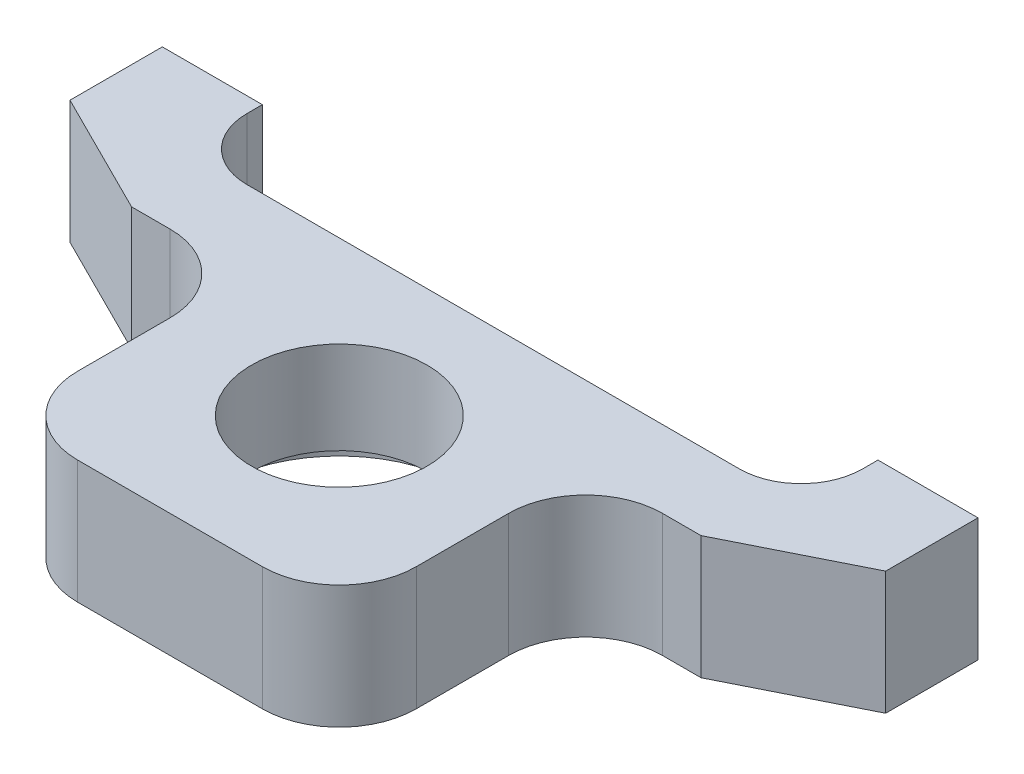
ISO-10303-21;
HEADER;
FILE_DESCRIPTION(('STEP AP214'),'2;1');
FILE_NAME('part.step','',(''),(''),'','','');
FILE_SCHEMA(('AUTOMOTIVE_DESIGN { 1 0 10303 214 1 1 1 1 }'));
ENDSEC;
DATA;
#1=APPLICATION_CONTEXT('core data for automotive mechanical design processes');
#2=APPLICATION_PROTOCOL_DEFINITION('international standard','automotive_design',2000,#1);
#3=PRODUCT_CONTEXT('',#1,'mechanical');
#4=PRODUCT('Part','Part','',(#3));
#5=PRODUCT_RELATED_PRODUCT_CATEGORY('part','',(#4));
#6=PRODUCT_DEFINITION_FORMATION('','',#4);
#7=PRODUCT_DEFINITION_CONTEXT('part definition',#1,'design');
#8=PRODUCT_DEFINITION('design','',#6,#7);
#9=PRODUCT_DEFINITION_SHAPE('','',#8);
#10=(LENGTH_UNIT() NAMED_UNIT(*) SI_UNIT(.MILLI.,.METRE.));
#11=(NAMED_UNIT(*) PLANE_ANGLE_UNIT() SI_UNIT($,.RADIAN.));
#12=(NAMED_UNIT(*) SI_UNIT($,.STERADIAN.) SOLID_ANGLE_UNIT());
#13=UNCERTAINTY_MEASURE_WITH_UNIT(LENGTH_MEASURE(1.E-05),#10,'distance_accuracy_value','');
#14=(GEOMETRIC_REPRESENTATION_CONTEXT(3) GLOBAL_UNCERTAINTY_ASSIGNED_CONTEXT((#13)) GLOBAL_UNIT_ASSIGNED_CONTEXT((#10,
#11,#12)) REPRESENTATION_CONTEXT('',''));
#15=CARTESIAN_POINT('',(0.,0.,0.));
#16=DIRECTION('',(0.,0.,1.));
#17=DIRECTION('',(1.,0.,0.));
#18=AXIS2_PLACEMENT_3D('',#15,#16,#17);
#19=CARTESIAN_POINT('',(-26.5,8.,0.));
#20=DIRECTION('',(0.,0.,-1.));
#21=DIRECTION('',(-1.,0.,0.));
#22=AXIS2_PLACEMENT_3D('',#19,#20,#21);
#23=PLANE('',#22);
#24=CARTESIAN_POINT('',(23.25,4.,0.));
#25=DIRECTION('',(0.,0.,-1.));
#26=DIRECTION('',(-1.,0.,0.));
#27=AXIS2_PLACEMENT_3D('',#24,#25,#26);
#28=CIRCLE('',#27,1.64999999999999);
#29=CARTESIAN_POINT('',(21.6,4.,0.));
#30=VERTEX_POINT('',#29);
#31=EDGE_CURVE('E184',#30,#30,#28,.T.);
#32=ORIENTED_EDGE('',*,*,#31,.F.);
#33=EDGE_LOOP('',(#32));
#34=FACE_BOUND('',#33,.T.);
#35=DIRECTION('',(0.,1.,0.));
#36=VECTOR('',#35,1.);
#37=CARTESIAN_POINT('',(20.,0.,0.));
#38=LINE('',#37,#36);
#39=CARTESIAN_POINT('',(20.,0.,0.));
#40=VERTEX_POINT('',#39);
#41=CARTESIAN_POINT('',(20.,8.,0.));
#42=VERTEX_POINT('',#41);
#43=EDGE_CURVE('E223',#40,#42,#38,.T.);
#44=ORIENTED_EDGE('',*,*,#43,.T.);
#45=DIRECTION('',(1.,0.,0.));
#46=VECTOR('',#45,1.);
#47=CARTESIAN_POINT('',(-26.5,8.,0.));
#48=LINE('',#47,#46);
#49=CARTESIAN_POINT('',(26.5,8.,0.));
#50=VERTEX_POINT('',#49);
#51=EDGE_CURVE('E254',#42,#50,#48,.T.);
#52=ORIENTED_EDGE('',*,*,#51,.T.);
#53=DIRECTION('',(0.,-1.,0.));
#54=VECTOR('',#53,1.);
#55=CARTESIAN_POINT('',(26.5,8.,0.));
#56=LINE('',#55,#54);
#57=CARTESIAN_POINT('',(26.5,0.,0.));
#58=VERTEX_POINT('',#57);
#59=EDGE_CURVE('E261',#50,#58,#56,.T.);
#60=ORIENTED_EDGE('',*,*,#59,.T.);
#61=DIRECTION('',(1.,0.,0.));
#62=VECTOR('',#61,1.);
#63=CARTESIAN_POINT('',(-26.5,0.,0.));
#64=LINE('',#63,#62);
#65=EDGE_CURVE('E246',#40,#58,#64,.T.);
#66=ORIENTED_EDGE('',*,*,#65,.F.);
#67=EDGE_LOOP('',(#44,#52,#60,#66));
#68=FACE_BOUND('',#67,.T.);
#69=ADVANCED_FACE('F32',(#34,#68),#23,.T.);
#70=CARTESIAN_POINT('',(-23.25,4.,0.));
#71=DIRECTION('',(0.,0.,-1.));
#72=DIRECTION('',(-1.,0.,0.));
#73=AXIS2_PLACEMENT_3D('',#70,#71,#72);
#74=CIRCLE('',#73,1.64999999999999);
#75=CARTESIAN_POINT('',(-24.9,4.,0.));
#76=VERTEX_POINT('',#75);
#77=EDGE_CURVE('E183',#76,#76,#74,.T.);
#78=ORIENTED_EDGE('',*,*,#77,.F.);
#79=EDGE_LOOP('',(#78));
#80=FACE_BOUND('',#79,.T.);
#81=DIRECTION('',(0.,1.,0.));
#82=VECTOR('',#81,1.);
#83=CARTESIAN_POINT('',(-20.000000023,0.,0.));
#84=LINE('',#83,#82);
#85=CARTESIAN_POINT('',(-20.000000023,0.,0.));
#86=VERTEX_POINT('',#85);
#87=CARTESIAN_POINT('',(-20.000000023,8.,0.));
#88=VERTEX_POINT('',#87);
#89=EDGE_CURVE('E216',#86,#88,#84,.T.);
#90=ORIENTED_EDGE('',*,*,#89,.F.);
#91=CARTESIAN_POINT('',(-26.5,0.,0.));
#92=VERTEX_POINT('',#91);
#93=EDGE_CURVE('E262',#92,#86,#64,.T.);
#94=ORIENTED_EDGE('',*,*,#93,.F.);
#95=DIRECTION('',(0.,-1.,0.));
#96=VECTOR('',#95,1.);
#97=CARTESIAN_POINT('',(-26.5,8.,0.));
#98=LINE('',#97,#96);
#99=CARTESIAN_POINT('',(-26.5,8.,0.));
#100=VERTEX_POINT('',#99);
#101=EDGE_CURVE('E272',#100,#92,#98,.T.);
#102=ORIENTED_EDGE('',*,*,#101,.F.);
#103=EDGE_CURVE('E250',#100,#88,#48,.T.);
#104=ORIENTED_EDGE('',*,*,#103,.T.);
#105=EDGE_LOOP('',(#90,#94,#102,#104));
#106=FACE_BOUND('',#105,.T.);
#107=ADVANCED_FACE('F404',(#80,#106),#23,.T.);
#108=CARTESIAN_POINT('',(-26.5,8.,26.));
#109=DIRECTION('',(-1.,0.,0.));
#110=DIRECTION('',(0.,0.,1.));
#111=AXIS2_PLACEMENT_3D('',#108,#109,#110);
#112=PLANE('',#111);
#113=DIRECTION('',(0.,0.,-1.));
#114=VECTOR('',#113,1.);
#115=CARTESIAN_POINT('',(-26.5,0.,26.));
#116=LINE('',#115,#114);
#117=CARTESIAN_POINT('',(-26.5,0.,5.99999999999999));
#118=VERTEX_POINT('',#117);
#119=EDGE_CURVE('E270',#118,#92,#116,.T.);
#120=ORIENTED_EDGE('',*,*,#119,.F.);
#121=DIRECTION('',(0.,1.,0.));
#122=VECTOR('',#121,1.);
#123=CARTESIAN_POINT('',(-26.5,8.,5.99999999999999));
#124=LINE('',#123,#122);
#125=CARTESIAN_POINT('',(-26.5,8.,5.99999999999999));
#126=VERTEX_POINT('',#125);
#127=EDGE_CURVE('E333',#118,#126,#124,.T.);
#128=ORIENTED_EDGE('',*,*,#127,.T.);
#129=DIRECTION('',(0.,0.,-1.));
#130=VECTOR('',#129,1.);
#131=CARTESIAN_POINT('',(-26.5,8.,26.));
#132=LINE('',#131,#130);
#133=EDGE_CURVE('E259',#126,#100,#132,.T.);
#134=ORIENTED_EDGE('',*,*,#133,.T.);
#135=ORIENTED_EDGE('',*,*,#101,.T.);
#136=EDGE_LOOP('',(#120,#128,#134,#135));
#137=FACE_BOUND('',#136,.T.);
#138=ADVANCED_FACE('F397',(#137),#112,.T.);
#139=CARTESIAN_POINT('',(26.5,8.,26.));
#140=DIRECTION('',(0.,0.,1.));
#141=DIRECTION('',(1.,0.,0.));
#142=AXIS2_PLACEMENT_3D('',#139,#140,#141);
#143=PLANE('',#142);
#144=DIRECTION('',(-1.,0.,0.));
#145=VECTOR('',#144,1.);
#146=CARTESIAN_POINT('',(26.5,0.,26.));
#147=LINE('',#146,#145);
#148=CARTESIAN_POINT('',(6.,0.,26.));
#149=VERTEX_POINT('',#148);
#150=CARTESIAN_POINT('',(-6.,0.,26.));
#151=VERTEX_POINT('',#150);
#152=EDGE_CURVE('E267',#149,#151,#147,.T.);
#153=ORIENTED_EDGE('',*,*,#152,.F.);
#154=DIRECTION('',(0.,1.,0.));
#155=VECTOR('',#154,1.);
#156=CARTESIAN_POINT('',(6.,8.,26.));
#157=LINE('',#156,#155);
#158=CARTESIAN_POINT('',(6.,8.,26.));
#159=VERTEX_POINT('',#158);
#160=EDGE_CURVE('E305',#149,#159,#157,.T.);
#161=ORIENTED_EDGE('',*,*,#160,.T.);
#162=DIRECTION('',(-1.,0.,0.));
#163=VECTOR('',#162,1.);
#164=CARTESIAN_POINT('',(26.5,8.,26.));
#165=LINE('',#164,#163);
#166=CARTESIAN_POINT('',(-6.,8.,26.));
#167=VERTEX_POINT('',#166);
#168=EDGE_CURVE('E256',#159,#167,#165,.T.);
#169=ORIENTED_EDGE('',*,*,#168,.T.);
#170=DIRECTION('',(0.,1.,0.));
#171=VECTOR('',#170,1.);
#172=CARTESIAN_POINT('',(-6.,0.,26.));
#173=LINE('',#172,#171);
#174=EDGE_CURVE('E303',#167,#151,#173,.F.);
#175=ORIENTED_EDGE('',*,*,#174,.T.);
#176=EDGE_LOOP('',(#153,#161,#169,#175));
#177=FACE_BOUND('',#176,.T.);
#178=ADVANCED_FACE('F371',(#177),#143,.T.);
#179=CARTESIAN_POINT('',(26.5,8.,0.));
#180=DIRECTION('',(1.,0.,0.));
#181=DIRECTION('',(0.,0.,-1.));
#182=AXIS2_PLACEMENT_3D('',#179,#180,#181);
#183=PLANE('',#182);
#184=DIRECTION('',(0.,0.,1.));
#185=VECTOR('',#184,1.);
#186=CARTESIAN_POINT('',(26.5,8.,0.));
#187=LINE('',#186,#185);
#188=CARTESIAN_POINT('',(26.5,8.,6.));
#189=VERTEX_POINT('',#188);
#190=EDGE_CURVE('E253',#50,#189,#187,.T.);
#191=ORIENTED_EDGE('',*,*,#190,.T.);
#192=DIRECTION('',(0.,-1.,0.));
#193=VECTOR('',#192,1.);
#194=CARTESIAN_POINT('',(26.5,0.,6.));
#195=LINE('',#194,#193);
#196=CARTESIAN_POINT('',(26.5,0.,6.));
#197=VERTEX_POINT('',#196);
#198=EDGE_CURVE('E40',#189,#197,#195,.T.);
#199=ORIENTED_EDGE('',*,*,#198,.T.);
#200=DIRECTION('',(0.,0.,1.));
#201=VECTOR('',#200,1.);
#202=CARTESIAN_POINT('',(26.5,0.,0.));
#203=LINE('',#202,#201);
#204=EDGE_CURVE('E265',#58,#197,#203,.T.);
#205=ORIENTED_EDGE('',*,*,#204,.F.);
#206=ORIENTED_EDGE('',*,*,#59,.F.);
#207=EDGE_LOOP('',(#191,#199,#205,#206));
#208=FACE_BOUND('',#207,.T.);
#209=ADVANCED_FACE('F430',(#208),#183,.T.);
#210=CARTESIAN_POINT('',(0.,8.,0.));
#211=DIRECTION('',(0.,-1.,0.));
#212=DIRECTION('',(0.,0.,-1.));
#213=AXIS2_PLACEMENT_3D('',#210,#211,#212);
#214=PLANE('',#213);
#215=CARTESIAN_POINT('',(0.,8.00000000000001,15.));
#216=DIRECTION('',(0.,-1.,0.));
#217=DIRECTION('',(0.,0.,-1.));
#218=AXIS2_PLACEMENT_3D('',#215,#216,#217);
#219=CIRCLE('',#218,5.70000000000001);
#220=CARTESIAN_POINT('',(0.,8.00000000000001,9.29999999999999));
#221=VERTEX_POINT('',#220);
#222=EDGE_CURVE('E203',#221,#221,#219,.T.);
#223=ORIENTED_EDGE('',*,*,#222,.T.);
#224=EDGE_LOOP('',(#223));
#225=FACE_BOUND('',#224,.T.);
#226=DIRECTION('',(-1.,0.,0.));
#227=VECTOR('',#226,1.);
#228=CARTESIAN_POINT('',(26.5,8.,10.));
#229=LINE('',#228,#227);
#230=CARTESIAN_POINT('',(18.5,8.,10.));
#231=VERTEX_POINT('',#230);
#232=CARTESIAN_POINT('',(16.,8.,10.));
#233=VERTEX_POINT('',#232);
#234=EDGE_CURVE('E235',#231,#233,#229,.T.);
#235=ORIENTED_EDGE('',*,*,#234,.F.);
#236=DIRECTION('',(0.894427190999917,0.,-0.447213595499956));
#237=VECTOR('',#236,1.);
#238=CARTESIAN_POINT('',(18.5,8.,10.));
#239=LINE('',#238,#237);
#240=EDGE_CURVE('E54',#231,#189,#239,.T.);
#241=ORIENTED_EDGE('',*,*,#240,.T.);
#242=ORIENTED_EDGE('',*,*,#190,.F.);
#243=ORIENTED_EDGE('',*,*,#51,.F.);
#244=DIRECTION('',(0.,0.,-1.));
#245=VECTOR('',#244,1.);
#246=CARTESIAN_POINT('',(20.,8.,5.));
#247=LINE('',#246,#245);
#248=CARTESIAN_POINT('',(20.,8.,1.));
#249=VERTEX_POINT('',#248);
#250=EDGE_CURVE('E211',#249,#42,#247,.T.);
#251=ORIENTED_EDGE('',*,*,#250,.F.);
#252=CARTESIAN_POINT('',(16.,8.,1.));
#253=DIRECTION('',(0.,-1.,0.));
#254=DIRECTION('',(0.,0.,-1.));
#255=AXIS2_PLACEMENT_3D('',#252,#253,#254);
#256=CIRCLE('',#255,4.);
#257=CARTESIAN_POINT('',(16.,8.,5.));
#258=VERTEX_POINT('',#257);
#259=EDGE_CURVE('E291',#249,#258,#256,.T.);
#260=ORIENTED_EDGE('',*,*,#259,.T.);
#261=DIRECTION('',(1.,0.,0.));
#262=VECTOR('',#261,1.);
#263=CARTESIAN_POINT('',(-20.000000023,8.,5.00000000000001));
#264=LINE('',#263,#262);
#265=CARTESIAN_POINT('',(-16.000000023,8.,5.00000000000001));
#266=VERTEX_POINT('',#265);
#267=EDGE_CURVE('E219',#266,#258,#264,.T.);
#268=ORIENTED_EDGE('',*,*,#267,.F.);
#269=CARTESIAN_POINT('',(-16.000000023,8.,1.00000000000001));
#270=DIRECTION('',(0.,-1.,0.));
#271=DIRECTION('',(0.,0.,-1.));
#272=AXIS2_PLACEMENT_3D('',#269,#270,#271);
#273=CIRCLE('',#272,4.);
#274=CARTESIAN_POINT('',(-20.000000023,8.,1.00000000000001));
#275=VERTEX_POINT('',#274);
#276=EDGE_CURVE('E287',#266,#275,#273,.T.);
#277=ORIENTED_EDGE('',*,*,#276,.T.);
#278=DIRECTION('',(0.,0.,1.));
#279=VECTOR('',#278,1.);
#280=CARTESIAN_POINT('',(-20.000000023,8.,0.));
#281=LINE('',#280,#279);
#282=EDGE_CURVE('E206',#88,#275,#281,.T.);
#283=ORIENTED_EDGE('',*,*,#282,.F.);
#284=ORIENTED_EDGE('',*,*,#103,.F.);
#285=ORIENTED_EDGE('',*,*,#133,.F.);
#286=DIRECTION('',(0.894427190999917,0.,0.447213595499956));
#287=VECTOR('',#286,1.);
#288=CARTESIAN_POINT('',(-26.5,8.,5.99999999999999));
#289=LINE('',#288,#287);
#290=CARTESIAN_POINT('',(-18.4999999999999,8.,10.));
#291=VERTEX_POINT('',#290);
#292=EDGE_CURVE('E336',#126,#291,#289,.T.);
#293=ORIENTED_EDGE('',*,*,#292,.T.);
#294=DIRECTION('',(-1.,0.,0.));
#295=VECTOR('',#294,1.);
#296=CARTESIAN_POINT('',(-11.,8.,10.));
#297=LINE('',#296,#295);
#298=CARTESIAN_POINT('',(-16.,8.,10.));
#299=VERTEX_POINT('',#298);
#300=EDGE_CURVE('E232',#299,#291,#297,.T.);
#301=ORIENTED_EDGE('',*,*,#300,.F.);
#302=CARTESIAN_POINT('',(-16.,8.,15.));
#303=DIRECTION('',(0.,-1.,0.));
#304=DIRECTION('',(0.,0.,-1.));
#305=AXIS2_PLACEMENT_3D('',#302,#303,#304);
#306=CIRCLE('',#305,5.);
#307=CARTESIAN_POINT('',(-11.,8.,15.));
#308=VERTEX_POINT('',#307);
#309=EDGE_CURVE('E329',#299,#308,#306,.T.);
#310=ORIENTED_EDGE('',*,*,#309,.T.);
#311=DIRECTION('',(0.,0.,-1.));
#312=VECTOR('',#311,1.);
#313=CARTESIAN_POINT('',(-11.,8.,26.));
#314=LINE('',#313,#312);
#315=CARTESIAN_POINT('',(-11.,8.,21.));
#316=VERTEX_POINT('',#315);
#317=EDGE_CURVE('E226',#316,#308,#314,.T.);
#318=ORIENTED_EDGE('',*,*,#317,.F.);
#319=CARTESIAN_POINT('',(-6.,8.,21.));
#320=DIRECTION('',(0.,-1.,0.));
#321=DIRECTION('',(0.,0.,-1.));
#322=AXIS2_PLACEMENT_3D('',#319,#320,#321);
#323=CIRCLE('',#322,5.);
#324=EDGE_CURVE('E308',#316,#167,#323,.F.);
#325=ORIENTED_EDGE('',*,*,#324,.T.);
#326=ORIENTED_EDGE('',*,*,#168,.F.);
#327=CARTESIAN_POINT('',(6.,8.,21.));
#328=DIRECTION('',(0.,-1.,0.));
#329=DIRECTION('',(0.,0.,-1.));
#330=AXIS2_PLACEMENT_3D('',#327,#328,#329);
#331=CIRCLE('',#330,5.);
#332=CARTESIAN_POINT('',(11.,8.,21.));
#333=VERTEX_POINT('',#332);
#334=EDGE_CURVE('E310',#159,#333,#331,.F.);
#335=ORIENTED_EDGE('',*,*,#334,.T.);
#336=DIRECTION('',(0.,0.,1.));
#337=VECTOR('',#336,1.);
#338=CARTESIAN_POINT('',(11.,8.,10.));
#339=LINE('',#338,#337);
#340=CARTESIAN_POINT('',(11.,8.,15.));
#341=VERTEX_POINT('',#340);
#342=EDGE_CURVE('E243',#341,#333,#339,.T.);
#343=ORIENTED_EDGE('',*,*,#342,.F.);
#344=CARTESIAN_POINT('',(16.,8.,15.));
#345=DIRECTION('',(0.,-1.,0.));
#346=DIRECTION('',(0.,0.,-1.));
#347=AXIS2_PLACEMENT_3D('',#344,#345,#346);
#348=CIRCLE('',#347,5.);
#349=EDGE_CURVE('E324',#341,#233,#348,.T.);
#350=ORIENTED_EDGE('',*,*,#349,.T.);
#351=EDGE_LOOP('',(#235,#241,#242,#243,#251,#260,#268,#277,#283,#284,#285,#293,#301,#310,#318,
#325,#326,#335,#343,#350));
#352=FACE_BOUND('',#351,.T.);
#353=ADVANCED_FACE('F351',(#225,#352),#214,.F.);
#354=CARTESIAN_POINT('',(0.,0.,0.));
#355=DIRECTION('',(0.,-1.,0.));
#356=DIRECTION('',(0.,0.,-1.));
#357=AXIS2_PLACEMENT_3D('',#354,#355,#356);
#358=PLANE('',#357);
#359=CARTESIAN_POINT('',(0.,0.,15.));
#360=DIRECTION('',(0.,-1.,0.));
#361=DIRECTION('',(0.,0.,-1.));
#362=AXIS2_PLACEMENT_3D('',#359,#360,#361);
#363=CIRCLE('',#362,8.1);
#364=CARTESIAN_POINT('',(0.,0.,6.9));
#365=VERTEX_POINT('',#364);
#366=EDGE_CURVE('E194',#365,#365,#363,.T.);
#367=ORIENTED_EDGE('',*,*,#366,.F.);
#368=EDGE_LOOP('',(#367));
#369=FACE_BOUND('',#368,.T.);
#370=ORIENTED_EDGE('',*,*,#204,.T.);
#371=DIRECTION('',(-0.894427190999917,0.,0.447213595499956));
#372=VECTOR('',#371,1.);
#373=CARTESIAN_POINT('',(7.69999999999995,0.,15.4));
#374=LINE('',#373,#372);
#375=CARTESIAN_POINT('',(18.5,0.,9.99999999999999));
#376=VERTEX_POINT('',#375);
#377=EDGE_CURVE('E11',#197,#376,#374,.T.);
#378=ORIENTED_EDGE('',*,*,#377,.T.);
#379=DIRECTION('',(-1.,0.,0.));
#380=VECTOR('',#379,1.);
#381=CARTESIAN_POINT('',(26.5,0.,10.));
#382=LINE('',#381,#380);
#383=CARTESIAN_POINT('',(16.,0.,10.));
#384=VERTEX_POINT('',#383);
#385=EDGE_CURVE('E240',#376,#384,#382,.T.);
#386=ORIENTED_EDGE('',*,*,#385,.T.);
#387=CARTESIAN_POINT('',(16.,0.,15.));
#388=DIRECTION('',(0.,-1.,0.));
#389=DIRECTION('',(0.,0.,-1.));
#390=AXIS2_PLACEMENT_3D('',#387,#388,#389);
#391=CIRCLE('',#390,5.);
#392=CARTESIAN_POINT('',(11.,0.,15.));
#393=VERTEX_POINT('',#392);
#394=EDGE_CURVE('E327',#384,#393,#391,.F.);
#395=ORIENTED_EDGE('',*,*,#394,.T.);
#396=DIRECTION('',(0.,0.,1.));
#397=VECTOR('',#396,1.);
#398=CARTESIAN_POINT('',(11.,0.,10.));
#399=LINE('',#398,#397);
#400=CARTESIAN_POINT('',(11.,0.,21.));
#401=VERTEX_POINT('',#400);
#402=EDGE_CURVE('E242',#393,#401,#399,.T.);
#403=ORIENTED_EDGE('',*,*,#402,.T.);
#404=CARTESIAN_POINT('',(6.,0.,21.));
#405=DIRECTION('',(0.,-1.,0.));
#406=DIRECTION('',(0.,0.,-1.));
#407=AXIS2_PLACEMENT_3D('',#404,#405,#406);
#408=CIRCLE('',#407,5.);
#409=EDGE_CURVE('E314',#401,#149,#408,.T.);
#410=ORIENTED_EDGE('',*,*,#409,.T.);
#411=ORIENTED_EDGE('',*,*,#152,.T.);
#412=CARTESIAN_POINT('',(-6.,0.,21.));
#413=DIRECTION('',(0.,-1.,0.));
#414=DIRECTION('',(0.,0.,-1.));
#415=AXIS2_PLACEMENT_3D('',#412,#413,#414);
#416=CIRCLE('',#415,5.);
#417=CARTESIAN_POINT('',(-11.,0.,21.));
#418=VERTEX_POINT('',#417);
#419=EDGE_CURVE('E312',#151,#418,#416,.T.);
#420=ORIENTED_EDGE('',*,*,#419,.T.);
#421=DIRECTION('',(0.,0.,-1.));
#422=VECTOR('',#421,1.);
#423=CARTESIAN_POINT('',(-11.,0.,26.));
#424=LINE('',#423,#422);
#425=CARTESIAN_POINT('',(-11.,0.,15.));
#426=VERTEX_POINT('',#425);
#427=EDGE_CURVE('E228',#418,#426,#424,.T.);
#428=ORIENTED_EDGE('',*,*,#427,.T.);
#429=CARTESIAN_POINT('',(-16.,0.,15.));
#430=DIRECTION('',(0.,-1.,0.));
#431=DIRECTION('',(0.,0.,-1.));
#432=AXIS2_PLACEMENT_3D('',#429,#430,#431);
#433=CIRCLE('',#432,5.);
#434=CARTESIAN_POINT('',(-16.,0.,10.));
#435=VERTEX_POINT('',#434);
#436=EDGE_CURVE('E331',#426,#435,#433,.F.);
#437=ORIENTED_EDGE('',*,*,#436,.T.);
#438=DIRECTION('',(-1.,0.,0.));
#439=VECTOR('',#438,1.);
#440=CARTESIAN_POINT('',(-11.,0.,10.));
#441=LINE('',#440,#439);
#442=CARTESIAN_POINT('',(-18.4999999999999,0.,10.));
#443=VERTEX_POINT('',#442);
#444=EDGE_CURVE('E231',#435,#443,#441,.T.);
#445=ORIENTED_EDGE('',*,*,#444,.T.);
#446=DIRECTION('',(-0.894427190999917,0.,-0.447213595499956));
#447=VECTOR('',#446,1.);
#448=CARTESIAN_POINT('',(-7.69999999999994,0.,15.4));
#449=LINE('',#448,#447);
#450=EDGE_CURVE('E340',#443,#118,#449,.T.);
#451=ORIENTED_EDGE('',*,*,#450,.T.);
#452=ORIENTED_EDGE('',*,*,#119,.T.);
#453=ORIENTED_EDGE('',*,*,#93,.T.);
#454=DIRECTION('',(0.,0.,1.));
#455=VECTOR('',#454,1.);
#456=CARTESIAN_POINT('',(-20.000000023,0.,0.));
#457=LINE('',#456,#455);
#458=CARTESIAN_POINT('',(-20.000000023,0.,1.00000000000001));
#459=VERTEX_POINT('',#458);
#460=EDGE_CURVE('E207',#86,#459,#457,.T.);
#461=ORIENTED_EDGE('',*,*,#460,.T.);
#462=CARTESIAN_POINT('',(-16.000000023,0.,1.00000000000001));
#463=DIRECTION('',(0.,-1.,0.));
#464=DIRECTION('',(0.,0.,-1.));
#465=AXIS2_PLACEMENT_3D('',#462,#463,#464);
#466=CIRCLE('',#465,4.);
#467=CARTESIAN_POINT('',(-16.000000023,0.,5.00000000000001));
#468=VERTEX_POINT('',#467);
#469=EDGE_CURVE('E289',#459,#468,#466,.F.);
#470=ORIENTED_EDGE('',*,*,#469,.T.);
#471=DIRECTION('',(1.,0.,0.));
#472=VECTOR('',#471,1.);
#473=CARTESIAN_POINT('',(-20.000000023,0.,5.00000000000001));
#474=LINE('',#473,#472);
#475=CARTESIAN_POINT('',(16.,0.,5.));
#476=VERTEX_POINT('',#475);
#477=EDGE_CURVE('E210',#468,#476,#474,.T.);
#478=ORIENTED_EDGE('',*,*,#477,.T.);
#479=CARTESIAN_POINT('',(16.,0.,1.));
#480=DIRECTION('',(0.,-1.,0.));
#481=DIRECTION('',(0.,0.,-1.));
#482=AXIS2_PLACEMENT_3D('',#479,#480,#481);
#483=CIRCLE('',#482,4.);
#484=CARTESIAN_POINT('',(20.,0.,1.));
#485=VERTEX_POINT('',#484);
#486=EDGE_CURVE('E293',#476,#485,#483,.F.);
#487=ORIENTED_EDGE('',*,*,#486,.T.);
#488=DIRECTION('',(0.,0.,-1.));
#489=VECTOR('',#488,1.);
#490=CARTESIAN_POINT('',(20.,0.,5.));
#491=LINE('',#490,#489);
#492=EDGE_CURVE('E214',#485,#40,#491,.T.);
#493=ORIENTED_EDGE('',*,*,#492,.T.);
#494=ORIENTED_EDGE('',*,*,#65,.T.);
#495=EDGE_LOOP('',(#370,#378,#386,#395,#403,#410,#411,#420,#428,#437,#445,#451,#452,#453,#461,
#470,#478,#487,#493,#494));
#496=FACE_BOUND('',#495,.T.);
#497=ADVANCED_FACE('F360',(#369,#496),#358,.T.);
#498=CARTESIAN_POINT('',(26.5,0.,10.));
#499=DIRECTION('',(0.,0.,-1.));
#500=DIRECTION('',(-1.,0.,0.));
#501=AXIS2_PLACEMENT_3D('',#498,#499,#500);
#502=PLANE('',#501);
#503=ORIENTED_EDGE('',*,*,#385,.F.);
#504=DIRECTION('',(0.,1.,0.));
#505=VECTOR('',#504,1.);
#506=CARTESIAN_POINT('',(18.5,8.,10.));
#507=LINE('',#506,#505);
#508=EDGE_CURVE('E342',#376,#231,#507,.T.);
#509=ORIENTED_EDGE('',*,*,#508,.T.);
#510=ORIENTED_EDGE('',*,*,#234,.T.);
#511=DIRECTION('',(0.,1.,0.));
#512=VECTOR('',#511,1.);
#513=CARTESIAN_POINT('',(16.,0.,10.));
#514=LINE('',#513,#512);
#515=EDGE_CURVE('E300',#233,#384,#514,.F.);
#516=ORIENTED_EDGE('',*,*,#515,.T.);
#517=EDGE_LOOP('',(#503,#509,#510,#516));
#518=FACE_BOUND('',#517,.T.);
#519=ADVANCED_FACE('F348',(#518),#502,.F.);
#520=CARTESIAN_POINT('',(11.,0.,10.));
#521=DIRECTION('',(-1.,0.,0.));
#522=DIRECTION('',(0.,0.,1.));
#523=AXIS2_PLACEMENT_3D('',#520,#521,#522);
#524=PLANE('',#523);
#525=ORIENTED_EDGE('',*,*,#402,.F.);
#526=DIRECTION('',(0.,1.,0.));
#527=VECTOR('',#526,1.);
#528=CARTESIAN_POINT('',(11.,8.,15.));
#529=LINE('',#528,#527);
#530=EDGE_CURVE('E297',#393,#341,#529,.T.);
#531=ORIENTED_EDGE('',*,*,#530,.T.);
#532=ORIENTED_EDGE('',*,*,#342,.T.);
#533=DIRECTION('',(0.,1.,0.));
#534=VECTOR('',#533,1.);
#535=CARTESIAN_POINT('',(11.,0.,21.));
#536=LINE('',#535,#534);
#537=EDGE_CURVE('E295',#333,#401,#536,.F.);
#538=ORIENTED_EDGE('',*,*,#537,.T.);
#539=EDGE_LOOP('',(#525,#531,#532,#538));
#540=FACE_BOUND('',#539,.T.);
#541=ADVANCED_FACE('F363',(#540),#524,.F.);
#542=CARTESIAN_POINT('',(-11.,0.,10.));
#543=DIRECTION('',(0.,0.,-1.));
#544=DIRECTION('',(-1.,0.,0.));
#545=AXIS2_PLACEMENT_3D('',#542,#543,#544);
#546=PLANE('',#545);
#547=ORIENTED_EDGE('',*,*,#300,.T.);
#548=DIRECTION('',(0.,-1.,0.));
#549=VECTOR('',#548,1.);
#550=CARTESIAN_POINT('',(-18.4999999999999,0.,10.));
#551=LINE('',#550,#549);
#552=EDGE_CURVE('E338',#291,#443,#551,.T.);
#553=ORIENTED_EDGE('',*,*,#552,.T.);
#554=ORIENTED_EDGE('',*,*,#444,.F.);
#555=DIRECTION('',(0.,1.,0.));
#556=VECTOR('',#555,1.);
#557=CARTESIAN_POINT('',(-16.,8.,10.));
#558=LINE('',#557,#556);
#559=EDGE_CURVE('E321',#435,#299,#558,.T.);
#560=ORIENTED_EDGE('',*,*,#559,.T.);
#561=EDGE_LOOP('',(#547,#553,#554,#560));
#562=FACE_BOUND('',#561,.T.);
#563=ADVANCED_FACE('F389',(#562),#546,.F.);
#564=CARTESIAN_POINT('',(-11.,0.,26.));
#565=DIRECTION('',(1.,0.,0.));
#566=DIRECTION('',(0.,0.,-1.));
#567=AXIS2_PLACEMENT_3D('',#564,#565,#566);
#568=PLANE('',#567);
#569=ORIENTED_EDGE('',*,*,#427,.F.);
#570=DIRECTION('',(0.,1.,0.));
#571=VECTOR('',#570,1.);
#572=CARTESIAN_POINT('',(-11.,8.,21.));
#573=LINE('',#572,#571);
#574=EDGE_CURVE('E318',#418,#316,#573,.T.);
#575=ORIENTED_EDGE('',*,*,#574,.T.);
#576=ORIENTED_EDGE('',*,*,#317,.T.);
#577=DIRECTION('',(0.,1.,0.));
#578=VECTOR('',#577,1.);
#579=CARTESIAN_POINT('',(-11.,0.,15.));
#580=LINE('',#579,#578);
#581=EDGE_CURVE('E316',#308,#426,#580,.F.);
#582=ORIENTED_EDGE('',*,*,#581,.T.);
#583=EDGE_LOOP('',(#569,#575,#576,#582));
#584=FACE_BOUND('',#583,.T.);
#585=ADVANCED_FACE('F380',(#584),#568,.F.);
#586=CARTESIAN_POINT('',(20.,0.,5.));
#587=DIRECTION('',(1.,0.,0.));
#588=DIRECTION('',(0.,0.,-1.));
#589=AXIS2_PLACEMENT_3D('',#586,#587,#588);
#590=PLANE('',#589);
#591=ORIENTED_EDGE('',*,*,#492,.F.);
#592=DIRECTION('',(0.,1.,0.));
#593=VECTOR('',#592,1.);
#594=CARTESIAN_POINT('',(20.,8.,1.));
#595=LINE('',#594,#593);
#596=EDGE_CURVE('E284',#485,#249,#595,.T.);
#597=ORIENTED_EDGE('',*,*,#596,.T.);
#598=ORIENTED_EDGE('',*,*,#250,.T.);
#599=ORIENTED_EDGE('',*,*,#43,.F.);
#600=EDGE_LOOP('',(#591,#597,#598,#599));
#601=FACE_BOUND('',#600,.T.);
#602=ADVANCED_FACE('F425',(#601),#590,.F.);
#603=CARTESIAN_POINT('',(-20.000000023,0.,5.00000000000001));
#604=DIRECTION('',(0.,0.,1.));
#605=DIRECTION('',(1.,0.,0.));
#606=AXIS2_PLACEMENT_3D('',#603,#604,#605);
#607=PLANE('',#606);
#608=ORIENTED_EDGE('',*,*,#477,.F.);
#609=DIRECTION('',(0.,1.,0.));
#610=VECTOR('',#609,1.);
#611=CARTESIAN_POINT('',(-16.000000023,8.,5.00000000000001));
#612=LINE('',#611,#610);
#613=EDGE_CURVE('E279',#468,#266,#612,.T.);
#614=ORIENTED_EDGE('',*,*,#613,.T.);
#615=ORIENTED_EDGE('',*,*,#267,.T.);
#616=DIRECTION('',(0.,1.,0.));
#617=VECTOR('',#616,1.);
#618=CARTESIAN_POINT('',(16.,0.,5.));
#619=LINE('',#618,#617);
#620=EDGE_CURVE('E275',#258,#476,#619,.F.);
#621=ORIENTED_EDGE('',*,*,#620,.T.);
#622=EDGE_LOOP('',(#608,#614,#615,#621));
#623=FACE_BOUND('',#622,.T.);
#624=ADVANCED_FACE('F414',(#623),#607,.F.);
#625=CARTESIAN_POINT('',(-20.000000023,0.,0.));
#626=DIRECTION('',(-1.,0.,0.));
#627=DIRECTION('',(0.,0.,1.));
#628=AXIS2_PLACEMENT_3D('',#625,#626,#627);
#629=PLANE('',#628);
#630=ORIENTED_EDGE('',*,*,#282,.T.);
#631=DIRECTION('',(0.,1.,0.));
#632=VECTOR('',#631,1.);
#633=CARTESIAN_POINT('',(-20.000000023,0.,1.00000000000001));
#634=LINE('',#633,#632);
#635=EDGE_CURVE('E282',#275,#459,#634,.F.);
#636=ORIENTED_EDGE('',*,*,#635,.T.);
#637=ORIENTED_EDGE('',*,*,#460,.F.);
#638=ORIENTED_EDGE('',*,*,#89,.T.);
#639=EDGE_LOOP('',(#630,#636,#637,#638));
#640=FACE_BOUND('',#639,.T.);
#641=ADVANCED_FACE('F581',(#640),#629,.F.);
#642=CARTESIAN_POINT('',(0.,0.,15.));
#643=DIRECTION('',(0.,-1.,0.));
#644=DIRECTION('',(0.,0.,-1.));
#645=AXIS2_PLACEMENT_3D('',#642,#643,#644);
#646=CYLINDRICAL_SURFACE('',#645,5.70000000000001);
#647=ORIENTED_EDGE('',*,*,#222,.F.);
#648=EDGE_LOOP('',(#647));
#649=FACE_BOUND('',#648,.T.);
#650=CARTESIAN_POINT('',(0.,2.,15.));
#651=DIRECTION('',(0.,-1.,0.));
#652=DIRECTION('',(0.,0.,-1.));
#653=AXIS2_PLACEMENT_3D('',#650,#651,#652);
#654=CIRCLE('',#653,5.70000000000001);
#655=CARTESIAN_POINT('',(0.,2.,9.29999999999999));
#656=VERTEX_POINT('',#655);
#657=EDGE_CURVE('E200',#656,#656,#654,.T.);
#658=ORIENTED_EDGE('',*,*,#657,.T.);
#659=EDGE_LOOP('',(#658));
#660=FACE_BOUND('',#659,.T.);
#661=ADVANCED_FACE('F586',(#649,#660),#646,.F.);
#662=CARTESIAN_POINT('',(5.70000000000001,2.,15.));
#663=DIRECTION('',(0.,1.,0.));
#664=DIRECTION('',(0.,0.,1.));
#665=AXIS2_PLACEMENT_3D('',#662,#663,#664);
#666=PLANE('',#665);
#667=ORIENTED_EDGE('',*,*,#657,.F.);
#668=EDGE_LOOP('',(#667));
#669=FACE_BOUND('',#668,.T.);
#670=CARTESIAN_POINT('',(0.,2.,15.));
#671=DIRECTION('',(0.,-1.,0.));
#672=DIRECTION('',(0.,0.,-1.));
#673=AXIS2_PLACEMENT_3D('',#670,#671,#672);
#674=CIRCLE('',#673,8.1);
#675=CARTESIAN_POINT('',(0.,2.,6.9));
#676=VERTEX_POINT('',#675);
#677=EDGE_CURVE('E197',#676,#676,#674,.T.);
#678=ORIENTED_EDGE('',*,*,#677,.T.);
#679=EDGE_LOOP('',(#678));
#680=FACE_BOUND('',#679,.T.);
#681=ADVANCED_FACE('F652',(#669,#680),#666,.F.);
#682=CARTESIAN_POINT('',(0.,0.,15.));
#683=DIRECTION('',(0.,-1.,0.));
#684=DIRECTION('',(0.,0.,-1.));
#685=AXIS2_PLACEMENT_3D('',#682,#683,#684);
#686=CYLINDRICAL_SURFACE('',#685,8.1);
#687=ORIENTED_EDGE('',*,*,#677,.F.);
#688=EDGE_LOOP('',(#687));
#689=FACE_BOUND('',#688,.T.);
#690=ORIENTED_EDGE('',*,*,#366,.T.);
#691=EDGE_LOOP('',(#690));
#692=FACE_BOUND('',#691,.T.);
#693=ADVANCED_FACE('F634',(#689,#692),#686,.F.);
#694=CARTESIAN_POINT('',(-23.25,4.,6.00000000000001));
#695=DIRECTION('',(0.,0.,-1.));
#696=DIRECTION('',(-1.,0.,0.));
#697=AXIS2_PLACEMENT_3D('',#694,#695,#696);
#698=CONICAL_SURFACE('',#697,1.64999999999998,1.02974425885275);
#699=CARTESIAN_POINT('',(-23.25,4.,6.99142002100001));
#700=VERTEX_POINT('',#699);
#701=VERTEX_LOOP('',#700);
#702=FACE_BOUND('',#701,.T.);
#703=CARTESIAN_POINT('',(-23.25,4.,6.00000000000001));
#704=DIRECTION('',(0.,0.,-1.));
#705=DIRECTION('',(-1.,0.,0.));
#706=AXIS2_PLACEMENT_3D('',#703,#704,#705);
#707=CIRCLE('',#706,1.64999999999998);
#708=CARTESIAN_POINT('',(-24.9,4.,6.00000000000001));
#709=VERTEX_POINT('',#708);
#710=EDGE_CURVE('E187',#709,#709,#707,.T.);
#711=ORIENTED_EDGE('',*,*,#710,.T.);
#712=EDGE_LOOP('',(#711));
#713=FACE_BOUND('',#712,.T.);
#714=ADVANCED_FACE('F624',(#702,#713),#698,.F.);
#715=CARTESIAN_POINT('',(-23.25,4.,0.));
#716=DIRECTION('',(0.,0.,-1.));
#717=DIRECTION('',(-1.,0.,0.));
#718=AXIS2_PLACEMENT_3D('',#715,#716,#717);
#719=CYLINDRICAL_SURFACE('',#718,1.64999999999999);
#720=ORIENTED_EDGE('',*,*,#710,.F.);
#721=EDGE_LOOP('',(#720));
#722=FACE_BOUND('',#721,.T.);
#723=ORIENTED_EDGE('',*,*,#77,.T.);
#724=EDGE_LOOP('',(#723));
#725=FACE_BOUND('',#724,.T.);
#726=ADVANCED_FACE('F177',(#722,#725),#719,.F.);
#727=CARTESIAN_POINT('',(23.25,4.,6.00000000000001));
#728=DIRECTION('',(0.,0.,-1.));
#729=DIRECTION('',(-1.,0.,0.));
#730=AXIS2_PLACEMENT_3D('',#727,#728,#729);
#731=CONICAL_SURFACE('',#730,1.64999999999998,1.02974425885275);
#732=CARTESIAN_POINT('',(23.25,4.,6.99142002100001));
#733=VERTEX_POINT('',#732);
#734=VERTEX_LOOP('',#733);
#735=FACE_BOUND('',#734,.T.);
#736=CARTESIAN_POINT('',(23.25,4.,6.00000000000001));
#737=DIRECTION('',(0.,0.,-1.));
#738=DIRECTION('',(-1.,0.,0.));
#739=AXIS2_PLACEMENT_3D('',#736,#737,#738);
#740=CIRCLE('',#739,1.64999999999998);
#741=CARTESIAN_POINT('',(21.6,4.,6.00000000000001));
#742=VERTEX_POINT('',#741);
#743=EDGE_CURVE('E181',#742,#742,#740,.T.);
#744=ORIENTED_EDGE('',*,*,#743,.T.);
#745=EDGE_LOOP('',(#744));
#746=FACE_BOUND('',#745,.T.);
#747=ADVANCED_FACE('F173',(#735,#746),#731,.F.);
#748=CARTESIAN_POINT('',(23.25,4.,0.));
#749=DIRECTION('',(0.,0.,-1.));
#750=DIRECTION('',(-1.,0.,0.));
#751=AXIS2_PLACEMENT_3D('',#748,#749,#750);
#752=CYLINDRICAL_SURFACE('',#751,1.64999999999999);
#753=ORIENTED_EDGE('',*,*,#743,.F.);
#754=EDGE_LOOP('',(#753));
#755=FACE_BOUND('',#754,.T.);
#756=ORIENTED_EDGE('',*,*,#31,.T.);
#757=EDGE_LOOP('',(#756));
#758=FACE_BOUND('',#757,.T.);
#759=ADVANCED_FACE('F176',(#755,#758),#752,.F.);
#760=CARTESIAN_POINT('',(-16.000000023,0.,1.00000000000001));
#761=DIRECTION('',(0.,-1.,0.));
#762=DIRECTION('',(0.,0.,-1.));
#763=AXIS2_PLACEMENT_3D('',#760,#761,#762);
#764=CYLINDRICAL_SURFACE('',#763,4.);
#765=ORIENTED_EDGE('',*,*,#469,.F.);
#766=ORIENTED_EDGE('',*,*,#635,.F.);
#767=ORIENTED_EDGE('',*,*,#276,.F.);
#768=ORIENTED_EDGE('',*,*,#613,.F.);
#769=EDGE_LOOP('',(#765,#766,#767,#768));
#770=FACE_BOUND('',#769,.T.);
#771=ADVANCED_FACE('F411',(#770),#764,.F.);
#772=CARTESIAN_POINT('',(16.,0.,1.));
#773=DIRECTION('',(0.,-1.,0.));
#774=DIRECTION('',(0.,0.,-1.));
#775=AXIS2_PLACEMENT_3D('',#772,#773,#774);
#776=CYLINDRICAL_SURFACE('',#775,4.);
#777=ORIENTED_EDGE('',*,*,#486,.F.);
#778=ORIENTED_EDGE('',*,*,#620,.F.);
#779=ORIENTED_EDGE('',*,*,#259,.F.);
#780=ORIENTED_EDGE('',*,*,#596,.F.);
#781=EDGE_LOOP('',(#777,#778,#779,#780));
#782=FACE_BOUND('',#781,.T.);
#783=ADVANCED_FACE('F422',(#782),#776,.F.);
#784=CARTESIAN_POINT('',(16.,0.,15.));
#785=DIRECTION('',(0.,-1.,0.));
#786=DIRECTION('',(0.,0.,-1.));
#787=AXIS2_PLACEMENT_3D('',#784,#785,#786);
#788=CYLINDRICAL_SURFACE('',#787,5.);
#789=ORIENTED_EDGE('',*,*,#394,.F.);
#790=ORIENTED_EDGE('',*,*,#515,.F.);
#791=ORIENTED_EDGE('',*,*,#349,.F.);
#792=ORIENTED_EDGE('',*,*,#530,.F.);
#793=EDGE_LOOP('',(#789,#790,#791,#792));
#794=FACE_BOUND('',#793,.T.);
#795=ADVANCED_FACE('F357',(#794),#788,.F.);
#796=CARTESIAN_POINT('',(6.,8.,21.));
#797=DIRECTION('',(0.,-1.,0.));
#798=DIRECTION('',(0.,0.,-1.));
#799=AXIS2_PLACEMENT_3D('',#796,#797,#798);
#800=CYLINDRICAL_SURFACE('',#799,5.);
#801=ORIENTED_EDGE('',*,*,#409,.F.);
#802=ORIENTED_EDGE('',*,*,#537,.F.);
#803=ORIENTED_EDGE('',*,*,#334,.F.);
#804=ORIENTED_EDGE('',*,*,#160,.F.);
#805=EDGE_LOOP('',(#801,#802,#803,#804));
#806=FACE_BOUND('',#805,.T.);
#807=ADVANCED_FACE('F366',(#806),#800,.T.);
#808=CARTESIAN_POINT('',(-6.,0.,21.));
#809=DIRECTION('',(0.,-1.,0.));
#810=DIRECTION('',(0.,0.,-1.));
#811=AXIS2_PLACEMENT_3D('',#808,#809,#810);
#812=CYLINDRICAL_SURFACE('',#811,5.);
#813=ORIENTED_EDGE('',*,*,#419,.F.);
#814=ORIENTED_EDGE('',*,*,#174,.F.);
#815=ORIENTED_EDGE('',*,*,#324,.F.);
#816=ORIENTED_EDGE('',*,*,#574,.F.);
#817=EDGE_LOOP('',(#813,#814,#815,#816));
#818=FACE_BOUND('',#817,.T.);
#819=ADVANCED_FACE('F375',(#818),#812,.T.);
#820=CARTESIAN_POINT('',(-16.,0.,15.));
#821=DIRECTION('',(0.,-1.,0.));
#822=DIRECTION('',(0.,0.,-1.));
#823=AXIS2_PLACEMENT_3D('',#820,#821,#822);
#824=CYLINDRICAL_SURFACE('',#823,5.);
#825=ORIENTED_EDGE('',*,*,#436,.F.);
#826=ORIENTED_EDGE('',*,*,#581,.F.);
#827=ORIENTED_EDGE('',*,*,#309,.F.);
#828=ORIENTED_EDGE('',*,*,#559,.F.);
#829=EDGE_LOOP('',(#825,#826,#827,#828));
#830=FACE_BOUND('',#829,.T.);
#831=ADVANCED_FACE('F384',(#830),#824,.F.);
#832=CARTESIAN_POINT('',(-26.5,8.,5.99999999999999));
#833=DIRECTION('',(-0.447213595499956,0.,0.894427190999917));
#834=DIRECTION('',(0.,-1.,0.));
#835=AXIS2_PLACEMENT_3D('',#832,#833,#834);
#836=PLANE('',#835);
#837=ORIENTED_EDGE('',*,*,#450,.F.);
#838=ORIENTED_EDGE('',*,*,#552,.F.);
#839=ORIENTED_EDGE('',*,*,#292,.F.);
#840=ORIENTED_EDGE('',*,*,#127,.F.);
#841=EDGE_LOOP('',(#837,#838,#839,#840));
#842=FACE_BOUND('',#841,.T.);
#843=ADVANCED_FACE('F393',(#842),#836,.T.);
#844=CARTESIAN_POINT('',(18.5,0.,10.));
#845=DIRECTION('',(0.447213595499956,0.,0.894427190999917));
#846=DIRECTION('',(0.,-1.,0.));
#847=AXIS2_PLACEMENT_3D('',#844,#845,#846);
#848=PLANE('',#847);
#849=ORIENTED_EDGE('',*,*,#377,.F.);
#850=ORIENTED_EDGE('',*,*,#198,.F.);
#851=ORIENTED_EDGE('',*,*,#240,.F.);
#852=ORIENTED_EDGE('',*,*,#508,.F.);
#853=EDGE_LOOP('',(#849,#850,#851,#852));
#854=FACE_BOUND('',#853,.T.);
#855=ADVANCED_FACE('F34',(#854),#848,.T.);
#856=CLOSED_SHELL('',(#69,#107,#138,#178,#209,#353,#497,#519,#541,#563,#585,#602,#624,#641,#661,
#681,#693,#714,#726,#747,#759,#771,#783,#795,#807,#819,#831,#843,#855));
#857=MANIFOLD_SOLID_BREP('B2',#856);
#858=ADVANCED_BREP_SHAPE_REPRESENTATION('',(#18,#857),#14);
#859=SHAPE_DEFINITION_REPRESENTATION(#9,#858);
ENDSEC;
END-ISO-10303-21;
